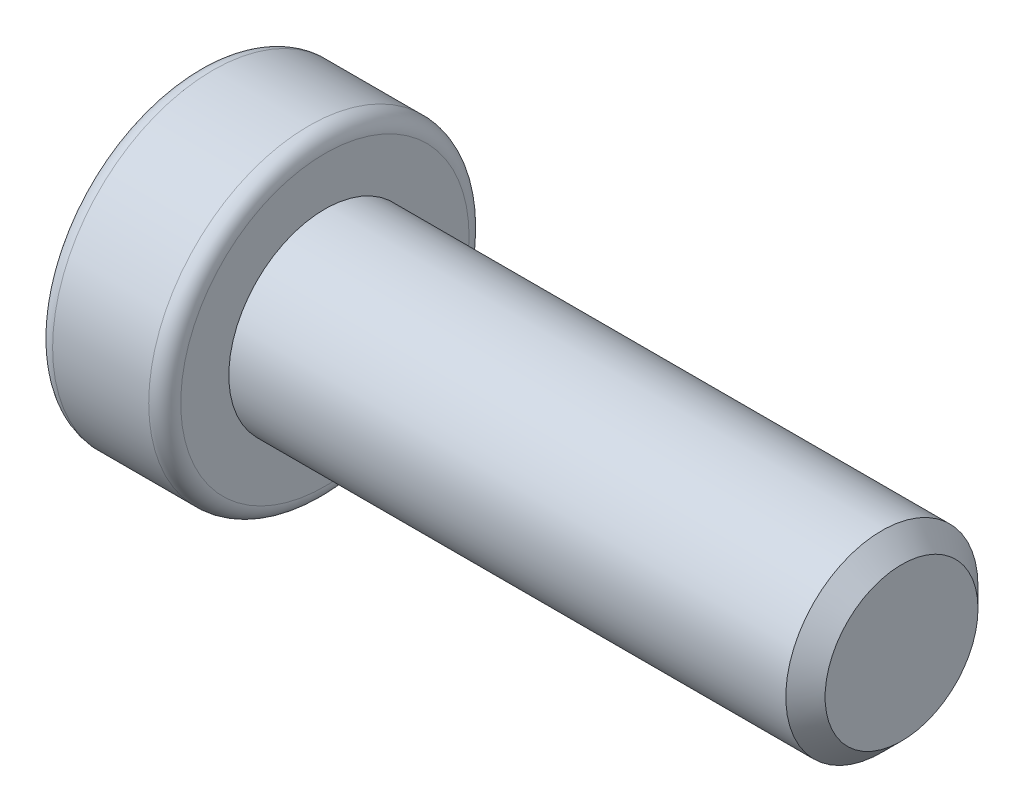
ISO-10303-21;
HEADER;
FILE_DESCRIPTION(('STEP AP214'),'2;1');
FILE_NAME('part.step','',(''),(''),'','','');
FILE_SCHEMA(('AUTOMOTIVE_DESIGN { 1 0 10303 214 1 1 1 1 }'));
ENDSEC;
DATA;
#1=APPLICATION_CONTEXT('core data for automotive mechanical design processes');
#2=APPLICATION_PROTOCOL_DEFINITION('international standard','automotive_design',2000,#1);
#3=PRODUCT_CONTEXT('',#1,'mechanical');
#4=PRODUCT('Part','Part','',(#3));
#5=PRODUCT_RELATED_PRODUCT_CATEGORY('part','',(#4));
#6=PRODUCT_DEFINITION_FORMATION('','',#4);
#7=PRODUCT_DEFINITION_CONTEXT('part definition',#1,'design');
#8=PRODUCT_DEFINITION('design','',#6,#7);
#9=PRODUCT_DEFINITION_SHAPE('','',#8);
#10=(LENGTH_UNIT() NAMED_UNIT(*) SI_UNIT(.MILLI.,.METRE.));
#11=(NAMED_UNIT(*) PLANE_ANGLE_UNIT() SI_UNIT($,.RADIAN.));
#12=(NAMED_UNIT(*) SI_UNIT($,.STERADIAN.) SOLID_ANGLE_UNIT());
#13=UNCERTAINTY_MEASURE_WITH_UNIT(LENGTH_MEASURE(1.E-05),#10,'distance_accuracy_value','');
#14=(GEOMETRIC_REPRESENTATION_CONTEXT(3) GLOBAL_UNCERTAINTY_ASSIGNED_CONTEXT((#13)) GLOBAL_UNIT_ASSIGNED_CONTEXT((#10,
#11,#12)) REPRESENTATION_CONTEXT('',''));
#15=CARTESIAN_POINT('',(0.,0.,0.));
#16=DIRECTION('',(0.,0.,1.));
#17=DIRECTION('',(1.,0.,0.));
#18=AXIS2_PLACEMENT_3D('',#15,#16,#17);
#19=CARTESIAN_POINT('',(-4.,0.,0.));
#20=DIRECTION('',(-1.,0.,0.));
#21=DIRECTION('',(0.,0.,1.));
#22=AXIS2_PLACEMENT_3D('',#19,#20,#21);
#23=CONICAL_SURFACE('',#22,2.8867513459481,0.785398163397447);
#24=CARTESIAN_POINT('',(-4.,0.,0.));
#25=DIRECTION('',(1.,0.,0.));
#26=DIRECTION('',(0.,0.,-1.));
#27=AXIS2_PLACEMENT_3D('',#24,#25,#26);
#28=CIRCLE('',#27,2.8867513459481);
#29=CARTESIAN_POINT('',(-4.,1.44337567297415,2.49999999999992));
#30=VERTEX_POINT('',#29);
#31=CARTESIAN_POINT('',(-4.,-1.4433756729741,2.5));
#32=VERTEX_POINT('',#31);
#33=EDGE_CURVE('E266',#30,#32,#28,.T.);
#34=ORIENTED_EDGE('',*,*,#33,.F.);
#35=CARTESIAN_POINT('',(-6.13577537813779,4.35611922405216,2.5));
#36=CARTESIAN_POINT('',(-6.02405641725019,4.22725866001411,2.5));
#37=CARTESIAN_POINT('',(-5.91298496215349,4.09782489086442,2.5));
#38=CARTESIAN_POINT('',(-5.69259879452268,3.83736651955329,2.5));
#39=CARTESIAN_POINT('',(-5.58328494304012,3.70634118973727,2.5));
#40=CARTESIAN_POINT('',(-5.3644942872461,3.43934006325918,2.5));
#41=CARTESIAN_POINT('',(-5.25507161834459,3.30331973073166,2.5));
#42=CARTESIAN_POINT('',(-5.03955046037824,3.02871290645588,2.5));
#43=CARTESIAN_POINT('',(-4.93345114490514,2.89012706652309,2.5));
#44=CARTESIAN_POINT('',(-4.72569625037672,2.60935358025566,2.5));
#45=CARTESIAN_POINT('',(-4.6240468245615,2.46716135079699,2.5));
#46=CARTESIAN_POINT('',(-4.42728703234703,2.17809364419259,2.5));
#47=CARTESIAN_POINT('',(-4.33218202887994,2.03121446717303,2.5));
#48=CARTESIAN_POINT('',(-4.15259291190784,1.73256542621068,2.5));
#49=CARTESIAN_POINT('',(-4.06803248336328,1.58084206421608,2.5));
#50=CARTESIAN_POINT('',(-3.91405163519297,1.26990866786595,2.5));
#51=CARTESIAN_POINT('',(-3.84460335921078,1.11071307737001,2.5));
#52=CARTESIAN_POINT('',(-3.75713367176379,0.863830735911973,2.5));
#53=CARTESIAN_POINT('',(-3.73056031651567,0.779188227940791,2.5));
#54=CARTESIAN_POINT('',(-3.68477521230842,0.607910212253461,2.5));
#55=CARTESIAN_POINT('',(-3.66556228833099,0.521275024991157,2.5));
#56=CARTESIAN_POINT('',(-3.63577461402971,0.347055167302584,2.5));
#57=CARTESIAN_POINT('',(-3.62514725633831,0.259479663207454,2.5));
#58=CARTESIAN_POINT('',(-3.61311288672129,0.0836918904943621,2.5));
#59=CARTESIAN_POINT('',(-3.61170490624327,-0.00452031025990465,2.5));
#60=CARTESIAN_POINT('',(-3.61822212538,-0.180706628736092,2.5));
#61=CARTESIAN_POINT('',(-3.62615950537357,-0.268680285623307,2.5));
#62=CARTESIAN_POINT('',(-3.65078694752075,-0.443384717226186,2.5));
#63=CARTESIAN_POINT('',(-3.66747873326785,-0.530115243734916,2.5));
#64=CARTESIAN_POINT('',(-3.70866876791723,-0.70232039045899,2.5));
#65=CARTESIAN_POINT('',(-3.73322158395549,-0.787781727344889,2.5));
#66=CARTESIAN_POINT('',(-3.78880674634175,-0.956537282986453,2.5));
#67=CARTESIAN_POINT('',(-3.81983916442736,-1.03983147773756,2.5));
#68=CARTESIAN_POINT('',(-3.89474881513276,-1.22278399037511,2.5));
#69=CARTESIAN_POINT('',(-3.93994460001272,-1.3218978611876,2.5));
#70=CARTESIAN_POINT('',(-4.03636406758988,-1.51717428919824,2.5));
#71=CARTESIAN_POINT('',(-4.08759123298222,-1.61333510041084,2.5));
#72=CARTESIAN_POINT('',(-4.19473393742912,-1.80324961470379,2.5));
#73=CARTESIAN_POINT('',(-4.25065896885275,-1.89699791868205,2.5));
#74=CARTESIAN_POINT('',(-4.3660273877593,-2.08226282648687,2.5));
#75=CARTESIAN_POINT('',(-4.4254700757917,-2.17377986890124,2.5));
#76=CARTESIAN_POINT('',(-4.54742331755096,-2.35544305197518,2.5));
#77=CARTESIAN_POINT('',(-4.60994847288594,-2.44557934493643,2.5));
#78=CARTESIAN_POINT('',(-4.73719466368033,-2.62429215374477,2.5));
#79=CARTESIAN_POINT('',(-4.80191586463725,-2.71286855126813,2.5));
#80=CARTESIAN_POINT('',(-4.99853021283134,-2.97643633428364,2.5));
#81=CARTESIAN_POINT('',(-5.13302426311325,-3.14948514704147,2.5));
#82=CARTESIAN_POINT('',(-5.41100964091669,-3.49742558299298,2.5));
#83=CARTESIAN_POINT('',(-5.55465127250697,-3.6721959345677,2.5));
#84=CARTESIAN_POINT('',(-5.77187642571591,-3.93128178305334,2.5));
#85=CARTESIAN_POINT('',(-5.84418027248006,-4.01667541105764,2.5));
#86=CARTESIAN_POINT('',(-5.98948272073259,-4.18683801333488,2.5));
#87=CARTESIAN_POINT('',(-6.06248116930567,-4.27160711812367,2.5));
#88=CARTESIAN_POINT('',(-6.13577537813778,-4.35611922405216,2.5));
#89=B_SPLINE_CURVE_WITH_KNOTS('',3,(#35,#36,#37,#38,#39,#40,#41,#42,#43,#44,#45,#46,#47,#48,#49,
#50,#51,#52,#53,#54,#55,#56,#57,#58,#59,#60,#61,#62,#63,#64,#65,#66,#67,#68,#69,#70,#71,#72,#73,
#74,#75,#76,#77,#78,#79,#80,#81,#82,#83,#84,#85,#86,#87,#88),.UNSPECIFIED.,.F.,.F.,(4,2,2,2,2,2,
2,2,2,2,2,2,2,2,2,2,2,2,2,2,2,2,2,2,2,2,4),(0.,0.511651260827455,1.02354597863304,
1.54722019644247,2.07076314295684,2.59500853626768,3.11967853721106,3.64029866615623,
4.15995084602471,4.42583268235064,4.69167205562896,4.95586989463534,5.22003997758481,
5.48455475102642,5.7491216224855,6.01556631338379,6.28201395432688,6.60853329817755,
6.93524211714075,7.26262772981255,7.58994846247599,7.91900556147604,8.24808751406481,
8.90545587878353,9.58407513821351,9.91974928830329,10.2553511756034),.UNSPECIFIED.);
#90=EDGE_CURVE('E65',#30,#32,#89,.T.);
#91=ORIENTED_EDGE('',*,*,#90,.T.);
#92=EDGE_LOOP('',(#34,#91));
#93=FACE_BOUND('',#92,.T.);
#94=ADVANCED_FACE('F42',(#93),#23,.F.);
#95=CARTESIAN_POINT('',(-4.,-2.8867513459481,0.));
#96=VERTEX_POINT('',#95);
#97=EDGE_CURVE('E271',#32,#96,#28,.T.);
#98=ORIENTED_EDGE('',*,*,#97,.F.);
#99=CARTESIAN_POINT('',(-4.00011547698181,-1.44326020292026,2.5002));
#100=CARTESIAN_POINT('',(-3.95054070535477,-1.49287669073472,2.41426172221223));
#101=CARTESIAN_POINT('',(-3.90387748136255,-1.54332283764113,2.32688643272424));
#102=CARTESIAN_POINT('',(-3.81843814003834,-1.64618811625262,2.1487185438344));
#103=CARTESIAN_POINT('',(-3.77970956240604,-1.69861703122362,2.05790899931892));
#104=CARTESIAN_POINT('',(-3.71336670389777,-1.80433744175988,1.87479587687306));
#105=CARTESIAN_POINT('',(-3.68558566853089,-1.85760201171318,1.78253893547064));
#106=CARTESIAN_POINT('',(-3.6427831759107,-1.96530378549012,1.59599399122369));
#107=CARTESIAN_POINT('',(-3.62772976667138,-2.01973769896309,1.50171168743369));
#108=CARTESIAN_POINT('',(-3.61414772220951,-2.11355131286835,1.33922174170813));
#109=CARTESIAN_POINT('',(-3.61213709924083,-2.15280980880343,1.27122403211982));
#110=CARTESIAN_POINT('',(-3.61552411718752,-2.23126263056551,1.13533975883075));
#111=CARTESIAN_POINT('',(-3.62092435529985,-2.27045692907359,1.06745324244773));
#112=CARTESIAN_POINT('',(-3.6388257884025,-2.34847544336506,0.932321211763864));
#113=CARTESIAN_POINT('',(-3.65133492704651,-2.38729919566124,0.865076500246409));
#114=CARTESIAN_POINT('',(-3.68276750195573,-2.46427534467604,0.73174989918177));
#115=CARTESIAN_POINT('',(-3.70169044649684,-2.50242779262542,0.665667920900312));
#116=CARTESIAN_POINT('',(-3.75786736140827,-2.60015256308362,0.496403653308709));
#117=CARTESIAN_POINT('',(-3.79935583159621,-2.65911894852988,0.394270877777087));
#118=CARTESIAN_POINT('',(-3.8693940467231,-2.74582384890656,0.244093585059479));
#119=CARTESIAN_POINT('',(-3.89400225211608,-2.7743969858641,0.194603460117381));
#120=CARTESIAN_POINT('',(-3.94546188671524,-2.83101398781791,0.0965399361611489));
#121=CARTESIAN_POINT('',(-3.97231193877936,-2.8590581649551,0.0479659965030702));
#122=CARTESIAN_POINT('',(-4.00011547698176,-2.88686681600194,-0.000199999999999587));
#123=B_SPLINE_CURVE_WITH_KNOTS('',3,(#99,#100,#101,#102,#103,#104,#105,#106,#107,#108,#109,#110,
#111,#112,#113,#114,#115,#116,#117,#118,#119,#120,#121,#122),.UNSPECIFIED.,.F.,.F.,(4,2,2,2,2,2,
2,2,2,2,2,4),(0.,0.33301208513393,0.667964518301408,0.997597032043316,1.32639954393847,
1.56169424147171,1.79707142102085,2.03271213522172,2.26833478775652,2.64260240809532,
2.82922877818861,3.01574133749021),.UNSPECIFIED.);
#124=EDGE_CURVE('E141',#32,#96,#123,.T.);
#125=ORIENTED_EDGE('',*,*,#124,.T.);
#126=EDGE_LOOP('',(#98,#125));
#127=FACE_BOUND('',#126,.T.);
#128=ADVANCED_FACE('F257',(#127),#23,.F.);
#129=CARTESIAN_POINT('',(-4.,-1.4433756729741,-2.5));
#130=VERTEX_POINT('',#129);
#131=EDGE_CURVE('E353',#96,#130,#28,.T.);
#132=ORIENTED_EDGE('',*,*,#131,.F.);
#133=CARTESIAN_POINT('',(-4.00011547698176,-2.88686681600194,0.000200000000000091));
#134=CARTESIAN_POINT('',(-3.95054070535473,-2.83725032818748,-0.0857382777877618));
#135=CARTESIAN_POINT('',(-3.90387748136251,-2.78680418128108,-0.173113567275748));
#136=CARTESIAN_POINT('',(-3.81843814003831,-2.68393890266959,-0.351281456165577));
#137=CARTESIAN_POINT('',(-3.77970956240602,-2.63150998769859,-0.44209100068106));
#138=CARTESIAN_POINT('',(-3.71336670389776,-2.52578957716234,-0.6252041231269));
#139=CARTESIAN_POINT('',(-3.68558566853088,-2.47252500720904,-0.717461064529317));
#140=CARTESIAN_POINT('',(-3.64278317591069,-2.36482323343211,-0.904006008776255));
#141=CARTESIAN_POINT('',(-3.62772976667137,-2.31038931995914,-0.998288312566249));
#142=CARTESIAN_POINT('',(-3.61414772220951,-2.21657570605389,-1.16077825829181));
#143=CARTESIAN_POINT('',(-3.61213709924083,-2.1773172101188,-1.22877596788011));
#144=CARTESIAN_POINT('',(-3.61552411718752,-2.09886438835673,-1.36466024116918));
#145=CARTESIAN_POINT('',(-3.62092435529985,-2.05967008984865,-1.4325467575522));
#146=CARTESIAN_POINT('',(-3.6388257884025,-1.98165157555718,-1.56767878823607));
#147=CARTESIAN_POINT('',(-3.65133492704651,-1.942827823261,-1.63492349975352));
#148=CARTESIAN_POINT('',(-3.68276750195574,-1.8658516742462,-1.76825010081816));
#149=CARTESIAN_POINT('',(-3.70169044649685,-1.82769922629682,-1.83433207909962));
#150=CARTESIAN_POINT('',(-3.75786736140828,-1.72997445583862,-2.00359634669123));
#151=CARTESIAN_POINT('',(-3.79935583159622,-1.67100807039235,-2.10572912222287));
#152=CARTESIAN_POINT('',(-3.86939404672313,-1.58430317001566,-2.25590641494049));
#153=CARTESIAN_POINT('',(-3.89400225211611,-1.55573003305811,-2.3053965398826));
#154=CARTESIAN_POINT('',(-3.94546188671528,-1.49911303110429,-2.40346006383884));
#155=CARTESIAN_POINT('',(-3.9723119387794,-1.4710688539671,-2.45203400349693));
#156=CARTESIAN_POINT('',(-4.00011547698181,-1.44326020292026,-2.5002));
#157=B_SPLINE_CURVE_WITH_KNOTS('',3,(#133,#134,#135,#136,#137,#138,#139,#140,#141,#142,#143,
#144,#145,#146,#147,#148,#149,#150,#151,#152,#153,#154,#155,#156),.UNSPECIFIED.,.F.,.F.,(4,2,2,
2,2,2,2,2,2,2,2,4),(0.,0.333012085133908,0.667964518301365,0.997597032043251,1.32639954393838,
1.56169424147162,1.79707142102076,2.03271213522164,2.26833478775643,2.64260240809528,
2.82922877818859,3.01574133749021),.UNSPECIFIED.);
#158=EDGE_CURVE('E193',#96,#130,#157,.T.);
#159=ORIENTED_EDGE('',*,*,#158,.T.);
#160=EDGE_LOOP('',(#132,#159));
#161=FACE_BOUND('',#160,.T.);
#162=ADVANCED_FACE('F262',(#161),#23,.F.);
#163=CARTESIAN_POINT('',(-4.,1.4433756729741,-2.5));
#164=VERTEX_POINT('',#163);
#165=EDGE_CURVE('E278',#130,#164,#28,.T.);
#166=ORIENTED_EDGE('',*,*,#165,.F.);
#167=CARTESIAN_POINT('',(-6.13577537813779,-4.35611922405216,-2.5));
#168=CARTESIAN_POINT('',(-6.02405641725019,-4.22725866001411,-2.5));
#169=CARTESIAN_POINT('',(-5.91298496215349,-4.09782489086442,-2.5));
#170=CARTESIAN_POINT('',(-5.69259879452268,-3.83736651955329,-2.5));
#171=CARTESIAN_POINT('',(-5.58328494304012,-3.70634118973727,-2.5));
#172=CARTESIAN_POINT('',(-5.3644942872461,-3.43934006325918,-2.5));
#173=CARTESIAN_POINT('',(-5.25507161834459,-3.30331973073166,-2.5));
#174=CARTESIAN_POINT('',(-5.03955046037824,-3.02871290645588,-2.5));
#175=CARTESIAN_POINT('',(-4.93345114490514,-2.89012706652309,-2.5));
#176=CARTESIAN_POINT('',(-4.72569625037672,-2.60935358025566,-2.5));
#177=CARTESIAN_POINT('',(-4.6240468245615,-2.46716135079699,-2.5));
#178=CARTESIAN_POINT('',(-4.42728703234703,-2.17809364419259,-2.5));
#179=CARTESIAN_POINT('',(-4.33218202887994,-2.03121446717303,-2.5));
#180=CARTESIAN_POINT('',(-4.15259291190784,-1.73256542621068,-2.5));
#181=CARTESIAN_POINT('',(-4.06803248336328,-1.58084206421608,-2.5));
#182=CARTESIAN_POINT('',(-3.91405163519297,-1.26990866786595,-2.5));
#183=CARTESIAN_POINT('',(-3.84460335921078,-1.11071307737001,-2.5));
#184=CARTESIAN_POINT('',(-3.75713367176379,-0.863830735911973,-2.5));
#185=CARTESIAN_POINT('',(-3.73056031651567,-0.779188227940791,-2.5));
#186=CARTESIAN_POINT('',(-3.68477521230842,-0.607910212253461,-2.5));
#187=CARTESIAN_POINT('',(-3.66556228833099,-0.521275024991157,-2.5));
#188=CARTESIAN_POINT('',(-3.63577461402971,-0.347055167302584,-2.5));
#189=CARTESIAN_POINT('',(-3.62514725633831,-0.259479663207454,-2.5));
#190=CARTESIAN_POINT('',(-3.61311288672129,-0.0836918904943621,-2.5));
#191=CARTESIAN_POINT('',(-3.61170490624327,0.00452031025990465,-2.5));
#192=CARTESIAN_POINT('',(-3.61822212538,0.180706628736092,-2.5));
#193=CARTESIAN_POINT('',(-3.62615950537357,0.268680285623307,-2.5));
#194=CARTESIAN_POINT('',(-3.65078694752075,0.443384717226186,-2.5));
#195=CARTESIAN_POINT('',(-3.66747873326785,0.530115243734916,-2.5));
#196=CARTESIAN_POINT('',(-3.70866876791723,0.70232039045899,-2.5));
#197=CARTESIAN_POINT('',(-3.73322158395549,0.787781727344889,-2.5));
#198=CARTESIAN_POINT('',(-3.78880674634175,0.956537282986453,-2.5));
#199=CARTESIAN_POINT('',(-3.81983916442736,1.03983147773756,-2.5));
#200=CARTESIAN_POINT('',(-3.89474881513276,1.22278399037511,-2.5));
#201=CARTESIAN_POINT('',(-3.93994460001272,1.3218978611876,-2.5));
#202=CARTESIAN_POINT('',(-4.03636406758988,1.51717428919824,-2.5));
#203=CARTESIAN_POINT('',(-4.08759123298222,1.61333510041084,-2.5));
#204=CARTESIAN_POINT('',(-4.19473393742912,1.80324961470379,-2.5));
#205=CARTESIAN_POINT('',(-4.25065896885275,1.89699791868205,-2.5));
#206=CARTESIAN_POINT('',(-4.3660273877593,2.08226282648687,-2.5));
#207=CARTESIAN_POINT('',(-4.4254700757917,2.17377986890124,-2.5));
#208=CARTESIAN_POINT('',(-4.54742331755096,2.35544305197518,-2.5));
#209=CARTESIAN_POINT('',(-4.60994847288594,2.44557934493643,-2.5));
#210=CARTESIAN_POINT('',(-4.73719466368033,2.62429215374477,-2.5));
#211=CARTESIAN_POINT('',(-4.80191586463725,2.71286855126813,-2.5));
#212=CARTESIAN_POINT('',(-4.99853021283134,2.97643633428364,-2.5));
#213=CARTESIAN_POINT('',(-5.13302426311325,3.14948514704147,-2.5));
#214=CARTESIAN_POINT('',(-5.41100964091669,3.49742558299298,-2.5));
#215=CARTESIAN_POINT('',(-5.55465127250697,3.6721959345677,-2.5));
#216=CARTESIAN_POINT('',(-5.77187642571591,3.93128178305334,-2.5));
#217=CARTESIAN_POINT('',(-5.84418027248006,4.01667541105764,-2.5));
#218=CARTESIAN_POINT('',(-5.98948272073259,4.18683801333488,-2.5));
#219=CARTESIAN_POINT('',(-6.06248116930567,4.27160711812367,-2.5));
#220=CARTESIAN_POINT('',(-6.13577537813778,4.35611922405216,-2.5));
#221=B_SPLINE_CURVE_WITH_KNOTS('',3,(#167,#168,#169,#170,#171,#172,#173,#174,#175,#176,#177,
#178,#179,#180,#181,#182,#183,#184,#185,#186,#187,#188,#189,#190,#191,#192,#193,#194,#195,#196,
#197,#198,#199,#200,#201,#202,#203,#204,#205,#206,#207,#208,#209,#210,#211,#212,#213,#214,#215,
#216,#217,#218,#219,#220),.UNSPECIFIED.,.F.,.F.,(4,2,2,2,2,2,2,2,2,2,2,2,2,2,2,2,2,2,2,2,2,2,2,
2,2,2,4),(0.,0.511651260827455,1.02354597863304,1.54722019644247,2.07076314295684,
2.59500853626768,3.11967853721106,3.64029866615623,4.15995084602471,4.42583268235064,
4.69167205562896,4.95586989463534,5.22003997758481,5.48455475102642,5.7491216224855,
6.01556631338379,6.28201395432688,6.60853329817755,6.93524211714075,7.26262772981255,
7.58994846247599,7.91900556147604,8.24808751406481,8.90545587878353,9.58407513821351,
9.91974928830329,10.2553511756034),.UNSPECIFIED.);
#222=EDGE_CURVE('E186',#130,#164,#221,.T.);
#223=ORIENTED_EDGE('',*,*,#222,.T.);
#224=EDGE_LOOP('',(#166,#223));
#225=FACE_BOUND('',#224,.T.);
#226=ADVANCED_FACE('F355',(#225),#23,.F.);
#227=CARTESIAN_POINT('',(-4.,2.8867513459481,0.));
#228=VERTEX_POINT('',#227);
#229=EDGE_CURVE('E276',#164,#228,#28,.T.);
#230=ORIENTED_EDGE('',*,*,#229,.F.);
#231=CARTESIAN_POINT('',(-4.00011547698181,1.44326020292026,-2.5002));
#232=CARTESIAN_POINT('',(-3.95054070535477,1.49287669073472,-2.41426172221223));
#233=CARTESIAN_POINT('',(-3.90387748136255,1.54332283764113,-2.32688643272424));
#234=CARTESIAN_POINT('',(-3.81843814003834,1.64618811625262,-2.1487185438344));
#235=CARTESIAN_POINT('',(-3.77970956240604,1.69861703122362,-2.05790899931892));
#236=CARTESIAN_POINT('',(-3.71336670389777,1.80433744175988,-1.87479587687306));
#237=CARTESIAN_POINT('',(-3.68558566853089,1.85760201171318,-1.78253893547064));
#238=CARTESIAN_POINT('',(-3.6427831759107,1.96530378549012,-1.59599399122369));
#239=CARTESIAN_POINT('',(-3.62772976667138,2.01973769896309,-1.50171168743369));
#240=CARTESIAN_POINT('',(-3.61414772220951,2.11355131286835,-1.33922174170813));
#241=CARTESIAN_POINT('',(-3.61213709924083,2.15280980880343,-1.27122403211982));
#242=CARTESIAN_POINT('',(-3.61552411718752,2.23126263056551,-1.13533975883075));
#243=CARTESIAN_POINT('',(-3.62092435529985,2.27045692907359,-1.06745324244773));
#244=CARTESIAN_POINT('',(-3.6388257884025,2.34847544336506,-0.932321211763864));
#245=CARTESIAN_POINT('',(-3.65133492704651,2.38729919566124,-0.865076500246409));
#246=CARTESIAN_POINT('',(-3.68276750195573,2.46427534467604,-0.73174989918177));
#247=CARTESIAN_POINT('',(-3.70169044649684,2.50242779262542,-0.665667920900312));
#248=CARTESIAN_POINT('',(-3.75786736140827,2.60015256308362,-0.496403653308709));
#249=CARTESIAN_POINT('',(-3.79935583159621,2.65911894852988,-0.394270877777087));
#250=CARTESIAN_POINT('',(-3.8693940467231,2.74582384890656,-0.244093585059479));
#251=CARTESIAN_POINT('',(-3.89400225211608,2.7743969858641,-0.194603460117381));
#252=CARTESIAN_POINT('',(-3.94546188671524,2.83101398781791,-0.0965399361611489));
#253=CARTESIAN_POINT('',(-3.97231193877936,2.8590581649551,-0.0479659965030702));
#254=CARTESIAN_POINT('',(-4.00011547698176,2.88686681600194,0.000199999999999587));
#255=B_SPLINE_CURVE_WITH_KNOTS('',3,(#231,#232,#233,#234,#235,#236,#237,#238,#239,#240,#241,
#242,#243,#244,#245,#246,#247,#248,#249,#250,#251,#252,#253,#254),.UNSPECIFIED.,.F.,.F.,(4,2,2,
2,2,2,2,2,2,2,2,4),(0.,0.33301208513393,0.667964518301408,0.997597032043316,1.32639954393847,
1.56169424147171,1.79707142102085,2.03271213522172,2.26833478775652,2.64260240809532,
2.82922877818861,3.01574133749021),.UNSPECIFIED.);
#256=EDGE_CURVE('E146',#164,#228,#255,.T.);
#257=ORIENTED_EDGE('',*,*,#256,.T.);
#258=EDGE_LOOP('',(#230,#257));
#259=FACE_BOUND('',#258,.T.);
#260=ADVANCED_FACE('F252',(#259),#23,.F.);
#261=EDGE_CURVE('E270',#228,#30,#28,.T.);
#262=ORIENTED_EDGE('',*,*,#261,.F.);
#263=CARTESIAN_POINT('',(-4.00011547698176,2.88686681600194,-0.000200000000000091));
#264=CARTESIAN_POINT('',(-3.95054070535473,2.83725032818748,0.0857382777877618));
#265=CARTESIAN_POINT('',(-3.90387748136251,2.78680418128108,0.173113567275748));
#266=CARTESIAN_POINT('',(-3.81843814003831,2.68393890266959,0.351281456165577));
#267=CARTESIAN_POINT('',(-3.77970956240602,2.63150998769859,0.44209100068106));
#268=CARTESIAN_POINT('',(-3.71336670389776,2.52578957716234,0.6252041231269));
#269=CARTESIAN_POINT('',(-3.68558566853088,2.47252500720904,0.717461064529317));
#270=CARTESIAN_POINT('',(-3.64278317591069,2.36482323343211,0.904006008776255));
#271=CARTESIAN_POINT('',(-3.62772976667137,2.31038931995914,0.998288312566249));
#272=CARTESIAN_POINT('',(-3.61414772220951,2.21657570605389,1.16077825829181));
#273=CARTESIAN_POINT('',(-3.61213709924083,2.1773172101188,1.22877596788011));
#274=CARTESIAN_POINT('',(-3.61552411718752,2.09886438835673,1.36466024116918));
#275=CARTESIAN_POINT('',(-3.62092435529985,2.05967008984865,1.4325467575522));
#276=CARTESIAN_POINT('',(-3.6388257884025,1.98165157555718,1.56767878823607));
#277=CARTESIAN_POINT('',(-3.65133492704651,1.942827823261,1.63492349975352));
#278=CARTESIAN_POINT('',(-3.68276750195574,1.8658516742462,1.76825010081816));
#279=CARTESIAN_POINT('',(-3.70169044649685,1.82769922629682,1.83433207909962));
#280=CARTESIAN_POINT('',(-3.75786736140828,1.72997445583862,2.00359634669123));
#281=CARTESIAN_POINT('',(-3.79935583159622,1.67100807039235,2.10572912222287));
#282=CARTESIAN_POINT('',(-3.86939404672313,1.58430317001566,2.25590641494049));
#283=CARTESIAN_POINT('',(-3.89400225211611,1.55573003305811,2.3053965398826));
#284=CARTESIAN_POINT('',(-3.94546188671528,1.49911303110429,2.40346006383884));
#285=CARTESIAN_POINT('',(-3.9723119387794,1.4710688539671,2.45203400349693));
#286=CARTESIAN_POINT('',(-4.00011547698181,1.44326020292026,2.5002));
#287=B_SPLINE_CURVE_WITH_KNOTS('',3,(#263,#264,#265,#266,#267,#268,#269,#270,#271,#272,#273,
#274,#275,#276,#277,#278,#279,#280,#281,#282,#283,#284,#285,#286),.UNSPECIFIED.,.F.,.F.,(4,2,2,
2,2,2,2,2,2,2,2,4),(0.,0.333012085133908,0.667964518301365,0.997597032043251,1.32639954393838,
1.56169424147162,1.79707142102076,2.03271213522164,2.26833478775643,2.64260240809528,
2.82922877818859,3.01574133749021),.UNSPECIFIED.);
#288=EDGE_CURVE('E142',#228,#30,#287,.T.);
#289=ORIENTED_EDGE('',*,*,#288,.T.);
#290=EDGE_LOOP('',(#262,#289));
#291=FACE_BOUND('',#290,.T.);
#292=ADVANCED_FACE('F247',(#291),#23,.F.);
#293=CARTESIAN_POINT('',(-4.,2.8867513459481,0.));
#294=DIRECTION('',(-1.,0.,0.));
#295=DIRECTION('',(0.,0.,1.));
#296=AXIS2_PLACEMENT_3D('',#293,#294,#295);
#297=PLANE('',#296);
#298=ORIENTED_EDGE('',*,*,#229,.T.);
#299=ORIENTED_EDGE('',*,*,#261,.T.);
#300=ORIENTED_EDGE('',*,*,#33,.T.);
#301=ORIENTED_EDGE('',*,*,#97,.T.);
#302=ORIENTED_EDGE('',*,*,#131,.T.);
#303=ORIENTED_EDGE('',*,*,#165,.T.);
#304=EDGE_LOOP('',(#298,#299,#300,#301,#302,#303));
#305=FACE_BOUND('',#304,.T.);
#306=CARTESIAN_POINT('',(-4.,0.,0.));
#307=DIRECTION('',(1.,0.,0.));
#308=DIRECTION('',(0.,0.,-1.));
#309=AXIS2_PLACEMENT_3D('',#306,#307,#308);
#310=CIRCLE('',#309,4.5);
#311=CARTESIAN_POINT('',(-4.,0.,-4.5));
#312=VERTEX_POINT('',#311);
#313=EDGE_CURVE('E281',#312,#312,#310,.T.);
#314=ORIENTED_EDGE('',*,*,#313,.F.);
#315=EDGE_LOOP('',(#314));
#316=FACE_BOUND('',#315,.T.);
#317=ADVANCED_FACE('F244',(#305,#316),#297,.T.);
#318=CARTESIAN_POINT('',(-3.50000000000009,0.,0.));
#319=DIRECTION('',(1.,0.,0.));
#320=DIRECTION('',(0.,0.,-1.));
#321=AXIS2_PLACEMENT_3D('',#318,#319,#320);
#322=TOROIDAL_SURFACE('',#321,4.50000000000009,0.49999999999991);
#323=ORIENTED_EDGE('',*,*,#313,.T.);
#324=EDGE_LOOP('',(#323));
#325=FACE_BOUND('',#324,.T.);
#326=CARTESIAN_POINT('',(-3.5,0.,0.));
#327=DIRECTION('',(1.,0.,0.));
#328=DIRECTION('',(0.,0.,-1.));
#329=AXIS2_PLACEMENT_3D('',#326,#327,#328);
#330=CIRCLE('',#329,5.);
#331=CARTESIAN_POINT('',(-3.5,0.,-5.));
#332=VERTEX_POINT('',#331);
#333=EDGE_CURVE('E357',#332,#332,#330,.T.);
#334=ORIENTED_EDGE('',*,*,#333,.F.);
#335=EDGE_LOOP('',(#334));
#336=FACE_BOUND('',#335,.T.);
#337=ADVANCED_FACE('F241',(#325,#336),#322,.T.);
#338=CARTESIAN_POINT('',(18.,0.,0.));
#339=DIRECTION('',(1.,0.,0.));
#340=DIRECTION('',(0.,0.,-1.));
#341=AXIS2_PLACEMENT_3D('',#338,#339,#340);
#342=CYLINDRICAL_SURFACE('',#341,5.);
#343=ORIENTED_EDGE('',*,*,#333,.T.);
#344=EDGE_LOOP('',(#343));
#345=FACE_BOUND('',#344,.T.);
#346=CARTESIAN_POINT('',(-0.5,0.,0.));
#347=DIRECTION('',(1.,0.,0.));
#348=DIRECTION('',(0.,0.,-1.));
#349=AXIS2_PLACEMENT_3D('',#346,#347,#348);
#350=CIRCLE('',#349,5.);
#351=CARTESIAN_POINT('',(-0.5,0.,-5.));
#352=VERTEX_POINT('',#351);
#353=EDGE_CURVE('E360',#352,#352,#350,.T.);
#354=ORIENTED_EDGE('',*,*,#353,.F.);
#355=EDGE_LOOP('',(#354));
#356=FACE_BOUND('',#355,.T.);
#357=ADVANCED_FACE('F237',(#345,#356),#342,.T.);
#358=CARTESIAN_POINT('',(-0.499999999999962,0.,0.));
#359=DIRECTION('',(1.,0.,0.));
#360=DIRECTION('',(0.,0.,-1.));
#361=AXIS2_PLACEMENT_3D('',#358,#359,#360);
#362=TOROIDAL_SURFACE('',#361,4.50000000000004,0.499999999999962);
#363=ORIENTED_EDGE('',*,*,#353,.T.);
#364=EDGE_LOOP('',(#363));
#365=FACE_BOUND('',#364,.T.);
#366=CARTESIAN_POINT('',(0.,0.,0.));
#367=DIRECTION('',(1.,0.,0.));
#368=DIRECTION('',(0.,0.,-1.));
#369=AXIS2_PLACEMENT_3D('',#366,#367,#368);
#370=CIRCLE('',#369,4.5);
#371=CARTESIAN_POINT('',(0.,0.,-4.5));
#372=VERTEX_POINT('',#371);
#373=EDGE_CURVE('E363',#372,#372,#370,.T.);
#374=ORIENTED_EDGE('',*,*,#373,.F.);
#375=EDGE_LOOP('',(#374));
#376=FACE_BOUND('',#375,.T.);
#377=ADVANCED_FACE('F233',(#365,#376),#362,.T.);
#378=CARTESIAN_POINT('',(0.,4.5,0.));
#379=DIRECTION('',(1.,0.,0.));
#380=DIRECTION('',(0.,0.,-1.));
#381=AXIS2_PLACEMENT_3D('',#378,#379,#380);
#382=PLANE('',#381);
#383=ORIENTED_EDGE('',*,*,#373,.T.);
#384=EDGE_LOOP('',(#383));
#385=FACE_BOUND('',#384,.T.);
#386=CARTESIAN_POINT('',(0.,0.,0.));
#387=DIRECTION('',(1.,0.,0.));
#388=DIRECTION('',(0.,0.,-1.));
#389=AXIS2_PLACEMENT_3D('',#386,#387,#388);
#390=CIRCLE('',#389,3.);
#391=CARTESIAN_POINT('',(0.,0.,-3.));
#392=VERTEX_POINT('',#391);
#393=EDGE_CURVE('E368',#392,#392,#390,.T.);
#394=ORIENTED_EDGE('',*,*,#393,.F.);
#395=EDGE_LOOP('',(#394));
#396=FACE_BOUND('',#395,.T.);
#397=ADVANCED_FACE('F229',(#385,#396),#382,.T.);
#398=CARTESIAN_POINT('',(18.,0.,0.));
#399=DIRECTION('',(1.,0.,0.));
#400=DIRECTION('',(0.,0.,-1.));
#401=AXIS2_PLACEMENT_3D('',#398,#399,#400);
#402=CYLINDRICAL_SURFACE('',#401,3.);
#403=ORIENTED_EDGE('',*,*,#393,.T.);
#404=EDGE_LOOP('',(#403));
#405=FACE_BOUND('',#404,.T.);
#406=CARTESIAN_POINT('',(17.3865,0.,0.));
#407=DIRECTION('',(1.,0.,0.));
#408=DIRECTION('',(0.,0.,-1.));
#409=AXIS2_PLACEMENT_3D('',#406,#407,#408);
#410=CIRCLE('',#409,3.);
#411=CARTESIAN_POINT('',(17.3865,0.,-3.));
#412=VERTEX_POINT('',#411);
#413=EDGE_CURVE('E371',#412,#412,#410,.T.);
#414=ORIENTED_EDGE('',*,*,#413,.F.);
#415=EDGE_LOOP('',(#414));
#416=FACE_BOUND('',#415,.T.);
#417=ADVANCED_FACE('F225',(#405,#416),#402,.T.);
#418=CARTESIAN_POINT('',(18.,0.,0.));
#419=DIRECTION('',(-1.,0.,0.));
#420=DIRECTION('',(0.,0.,1.));
#421=AXIS2_PLACEMENT_3D('',#418,#419,#420);
#422=CONICAL_SURFACE('',#421,2.3865,0.785398163397449);
#423=ORIENTED_EDGE('',*,*,#413,.T.);
#424=EDGE_LOOP('',(#423));
#425=FACE_BOUND('',#424,.T.);
#426=CARTESIAN_POINT('',(18.,0.,0.));
#427=DIRECTION('',(1.,0.,0.));
#428=DIRECTION('',(0.,0.,-1.));
#429=AXIS2_PLACEMENT_3D('',#426,#427,#428);
#430=CIRCLE('',#429,2.3865);
#431=CARTESIAN_POINT('',(18.,0.,-2.3865));
#432=VERTEX_POINT('',#431);
#433=EDGE_CURVE('E373',#432,#432,#430,.T.);
#434=ORIENTED_EDGE('',*,*,#433,.F.);
#435=EDGE_LOOP('',(#434));
#436=FACE_BOUND('',#435,.T.);
#437=ADVANCED_FACE('F221',(#425,#436),#422,.T.);
#438=CARTESIAN_POINT('',(18.,2.3865,0.));
#439=DIRECTION('',(1.,0.,0.));
#440=DIRECTION('',(0.,0.,-1.));
#441=AXIS2_PLACEMENT_3D('',#438,#439,#440);
#442=PLANE('',#441);
#443=ORIENTED_EDGE('',*,*,#433,.T.);
#444=EDGE_LOOP('',(#443));
#445=FACE_BOUND('',#444,.T.);
#446=ADVANCED_FACE('F217',(#445),#442,.T.);
#447=CARTESIAN_POINT('',(-1.5,0.,0.));
#448=DIRECTION('',(1.,0.,0.));
#449=DIRECTION('',(0.,0.,-1.));
#450=AXIS2_PLACEMENT_3D('',#447,#448,#449);
#451=PLANE('',#450);
#452=CARTESIAN_POINT('',(-1.5,0.,0.));
#453=DIRECTION('',(1.,0.,0.));
#454=DIRECTION('',(0.,0.,-1.));
#455=AXIS2_PLACEMENT_3D('',#452,#453,#454);
#456=CIRCLE('',#455,2.5);
#457=CARTESIAN_POINT('',(-1.5,0.,-2.5));
#458=VERTEX_POINT('',#457);
#459=CARTESIAN_POINT('',(-1.5,2.16506350946112,-1.24999999999996));
#460=VERTEX_POINT('',#459);
#461=EDGE_CURVE('E283',#458,#460,#456,.T.);
#462=ORIENTED_EDGE('',*,*,#461,.T.);
#463=DIRECTION('',(0.,0.499999999999983,0.866025403784448));
#464=VECTOR('',#463,1.);
#465=CARTESIAN_POINT('',(-1.5,1.4433756729741,-2.5));
#466=LINE('',#465,#464);
#467=CARTESIAN_POINT('',(-1.5,1.4433756729741,-2.5));
#468=VERTEX_POINT('',#467);
#469=EDGE_CURVE('E329',#468,#460,#466,.T.);
#470=ORIENTED_EDGE('',*,*,#469,.F.);
#471=DIRECTION('',(0.,1.,0.));
#472=VECTOR('',#471,1.);
#473=CARTESIAN_POINT('',(-1.5,-1.4433756729741,-2.5));
#474=LINE('',#473,#472);
#475=EDGE_CURVE('E326',#458,#468,#474,.T.);
#476=ORIENTED_EDGE('',*,*,#475,.F.);
#477=EDGE_LOOP('',(#462,#470,#476));
#478=FACE_BOUND('',#477,.T.);
#479=ADVANCED_FACE('F220',(#478),#451,.F.);
#480=CARTESIAN_POINT('',(-1.5,2.16506350946112,1.24999999999996));
#481=VERTEX_POINT('',#480);
#482=EDGE_CURVE('E284',#460,#481,#456,.T.);
#483=ORIENTED_EDGE('',*,*,#482,.T.);
#484=DIRECTION('',(0.,-0.499999999999983,0.866025403784448));
#485=VECTOR('',#484,1.);
#486=CARTESIAN_POINT('',(-1.5,2.8867513459481,0.));
#487=LINE('',#486,#485);
#488=CARTESIAN_POINT('',(-1.5,2.8867513459481,0.));
#489=VERTEX_POINT('',#488);
#490=EDGE_CURVE('E340',#489,#481,#487,.T.);
#491=ORIENTED_EDGE('',*,*,#490,.F.);
#492=EDGE_CURVE('E335',#460,#489,#466,.T.);
#493=ORIENTED_EDGE('',*,*,#492,.F.);
#494=EDGE_LOOP('',(#483,#491,#493));
#495=FACE_BOUND('',#494,.T.);
#496=ADVANCED_FACE('F308',(#495),#451,.F.);
#497=CARTESIAN_POINT('',(-1.5,0.,2.5));
#498=VERTEX_POINT('',#497);
#499=EDGE_CURVE('E393',#481,#498,#456,.T.);
#500=ORIENTED_EDGE('',*,*,#499,.T.);
#501=DIRECTION('',(0.,-1.,0.));
#502=VECTOR('',#501,1.);
#503=CARTESIAN_POINT('',(-1.5,1.4433756729741,2.5));
#504=LINE('',#503,#502);
#505=CARTESIAN_POINT('',(-1.5,1.4433756729741,2.5));
#506=VERTEX_POINT('',#505);
#507=EDGE_CURVE('E124',#506,#498,#504,.T.);
#508=ORIENTED_EDGE('',*,*,#507,.F.);
#509=EDGE_CURVE('E339',#481,#506,#487,.T.);
#510=ORIENTED_EDGE('',*,*,#509,.F.);
#511=EDGE_LOOP('',(#500,#508,#510));
#512=FACE_BOUND('',#511,.T.);
#513=ADVANCED_FACE('F315',(#512),#451,.F.);
#514=CARTESIAN_POINT('',(-1.5,-2.16506350946112,1.24999999999996));
#515=VERTEX_POINT('',#514);
#516=EDGE_CURVE('E131',#498,#515,#456,.T.);
#517=ORIENTED_EDGE('',*,*,#516,.T.);
#518=DIRECTION('',(0.,-0.499999999999983,-0.866025403784448));
#519=VECTOR('',#518,1.);
#520=CARTESIAN_POINT('',(-1.5,-1.4433756729741,2.5));
#521=LINE('',#520,#519);
#522=CARTESIAN_POINT('',(-1.5,-1.4433756729741,2.5));
#523=VERTEX_POINT('',#522);
#524=EDGE_CURVE('E129',#523,#515,#521,.T.);
#525=ORIENTED_EDGE('',*,*,#524,.F.);
#526=EDGE_CURVE('E118',#498,#523,#504,.T.);
#527=ORIENTED_EDGE('',*,*,#526,.F.);
#528=EDGE_LOOP('',(#517,#525,#527));
#529=FACE_BOUND('',#528,.T.);
#530=ADVANCED_FACE('F130',(#529),#451,.F.);
#531=CARTESIAN_POINT('',(-1.5,-2.16506350946112,-1.24999999999996));
#532=VERTEX_POINT('',#531);
#533=EDGE_CURVE('E317',#515,#532,#456,.T.);
#534=ORIENTED_EDGE('',*,*,#533,.T.);
#535=DIRECTION('',(0.,0.499999999999983,-0.866025403784448));
#536=VECTOR('',#535,1.);
#537=CARTESIAN_POINT('',(-1.5,-2.8867513459481,0.));
#538=LINE('',#537,#536);
#539=CARTESIAN_POINT('',(-1.5,-2.8867513459481,0.));
#540=VERTEX_POINT('',#539);
#541=EDGE_CURVE('E57',#540,#532,#538,.T.);
#542=ORIENTED_EDGE('',*,*,#541,.F.);
#543=EDGE_CURVE('E136',#515,#540,#521,.T.);
#544=ORIENTED_EDGE('',*,*,#543,.F.);
#545=EDGE_LOOP('',(#534,#542,#544));
#546=FACE_BOUND('',#545,.T.);
#547=ADVANCED_FACE('F216',(#546),#451,.F.);
#548=CARTESIAN_POINT('',(-1.5,1.4433756729741,2.5));
#549=DIRECTION('',(0.,0.,-1.));
#550=DIRECTION('',(-1.,0.,0.));
#551=AXIS2_PLACEMENT_3D('',#548,#549,#550);
#552=PLANE('',#551);
#553=ORIENTED_EDGE('',*,*,#90,.F.);
#554=DIRECTION('',(-1.,0.,0.));
#555=VECTOR('',#554,1.);
#556=CARTESIAN_POINT('',(-1.5,1.4433756729741,2.5));
#557=LINE('',#556,#555);
#558=EDGE_CURVE('E343',#506,#30,#557,.T.);
#559=ORIENTED_EDGE('',*,*,#558,.F.);
#560=ORIENTED_EDGE('',*,*,#507,.T.);
#561=ORIENTED_EDGE('',*,*,#526,.T.);
#562=DIRECTION('',(-1.,0.,0.));
#563=VECTOR('',#562,1.);
#564=CARTESIAN_POINT('',(-1.5,-1.4433756729741,2.5));
#565=LINE('',#564,#563);
#566=EDGE_CURVE('E122',#523,#32,#565,.T.);
#567=ORIENTED_EDGE('',*,*,#566,.T.);
#568=EDGE_LOOP('',(#553,#559,#560,#561,#567));
#569=FACE_BOUND('',#568,.T.);
#570=ADVANCED_FACE('F120',(#569),#552,.T.);
#571=CARTESIAN_POINT('',(-1.5,-1.4433756729741,2.5));
#572=DIRECTION('',(0.,0.866025403784448,-0.499999999999983));
#573=DIRECTION('',(0.,0.499999999999983,0.866025403784448));
#574=AXIS2_PLACEMENT_3D('',#571,#572,#573);
#575=PLANE('',#574);
#576=ORIENTED_EDGE('',*,*,#124,.F.);
#577=ORIENTED_EDGE('',*,*,#566,.F.);
#578=ORIENTED_EDGE('',*,*,#524,.T.);
#579=ORIENTED_EDGE('',*,*,#543,.T.);
#580=DIRECTION('',(-1.,0.,0.));
#581=VECTOR('',#580,1.);
#582=CARTESIAN_POINT('',(-1.5,-2.8867513459481,0.));
#583=LINE('',#582,#581);
#584=EDGE_CURVE('E143',#540,#96,#583,.T.);
#585=ORIENTED_EDGE('',*,*,#584,.T.);
#586=EDGE_LOOP('',(#576,#577,#578,#579,#585));
#587=FACE_BOUND('',#586,.T.);
#588=ADVANCED_FACE('F138',(#587),#575,.T.);
#589=CARTESIAN_POINT('',(-1.5,-2.8867513459481,0.));
#590=DIRECTION('',(0.,0.866025403784448,0.499999999999983));
#591=DIRECTION('',(0.,-0.499999999999983,0.866025403784448));
#592=AXIS2_PLACEMENT_3D('',#589,#590,#591);
#593=PLANE('',#592);
#594=ORIENTED_EDGE('',*,*,#158,.F.);
#595=ORIENTED_EDGE('',*,*,#584,.F.);
#596=ORIENTED_EDGE('',*,*,#541,.T.);
#597=CARTESIAN_POINT('',(-1.5,-1.4433756729741,-2.5));
#598=VERTEX_POINT('',#597);
#599=EDGE_CURVE('E135',#532,#598,#538,.T.);
#600=ORIENTED_EDGE('',*,*,#599,.T.);
#601=DIRECTION('',(-1.,0.,0.));
#602=VECTOR('',#601,1.);
#603=CARTESIAN_POINT('',(-1.5,-1.4433756729741,-2.5));
#604=LINE('',#603,#602);
#605=EDGE_CURVE('E148',#598,#130,#604,.T.);
#606=ORIENTED_EDGE('',*,*,#605,.T.);
#607=EDGE_LOOP('',(#594,#595,#596,#600,#606));
#608=FACE_BOUND('',#607,.T.);
#609=ADVANCED_FACE('F182',(#608),#593,.T.);
#610=CARTESIAN_POINT('',(-1.5,-1.4433756729741,-2.5));
#611=DIRECTION('',(0.,0.,1.));
#612=DIRECTION('',(1.,0.,0.));
#613=AXIS2_PLACEMENT_3D('',#610,#611,#612);
#614=PLANE('',#613);
#615=ORIENTED_EDGE('',*,*,#222,.F.);
#616=ORIENTED_EDGE('',*,*,#605,.F.);
#617=EDGE_CURVE('E324',#598,#458,#474,.T.);
#618=ORIENTED_EDGE('',*,*,#617,.T.);
#619=ORIENTED_EDGE('',*,*,#475,.T.);
#620=DIRECTION('',(-1.,0.,0.));
#621=VECTOR('',#620,1.);
#622=CARTESIAN_POINT('',(-1.5,1.4433756729741,-2.5));
#623=LINE('',#622,#621);
#624=EDGE_CURVE('E348',#468,#164,#623,.T.);
#625=ORIENTED_EDGE('',*,*,#624,.T.);
#626=EDGE_LOOP('',(#615,#616,#618,#619,#625));
#627=FACE_BOUND('',#626,.T.);
#628=ADVANCED_FACE('F177',(#627),#614,.T.);
#629=CARTESIAN_POINT('',(-1.5,1.4433756729741,-2.5));
#630=DIRECTION('',(0.,-0.866025403784448,0.499999999999983));
#631=DIRECTION('',(0.,-0.499999999999983,-0.866025403784448));
#632=AXIS2_PLACEMENT_3D('',#629,#630,#631);
#633=PLANE('',#632);
#634=ORIENTED_EDGE('',*,*,#256,.F.);
#635=ORIENTED_EDGE('',*,*,#624,.F.);
#636=ORIENTED_EDGE('',*,*,#469,.T.);
#637=ORIENTED_EDGE('',*,*,#492,.T.);
#638=DIRECTION('',(-1.,0.,0.));
#639=VECTOR('',#638,1.);
#640=CARTESIAN_POINT('',(-1.5,2.8867513459481,0.));
#641=LINE('',#640,#639);
#642=EDGE_CURVE('E345',#489,#228,#641,.T.);
#643=ORIENTED_EDGE('',*,*,#642,.T.);
#644=EDGE_LOOP('',(#634,#635,#636,#637,#643));
#645=FACE_BOUND('',#644,.T.);
#646=ADVANCED_FACE('F172',(#645),#633,.T.);
#647=CARTESIAN_POINT('',(-1.5,2.8867513459481,0.));
#648=DIRECTION('',(0.,-0.866025403784448,-0.499999999999983));
#649=DIRECTION('',(0.,0.499999999999983,-0.866025403784448));
#650=AXIS2_PLACEMENT_3D('',#647,#648,#649);
#651=PLANE('',#650);
#652=ORIENTED_EDGE('',*,*,#288,.F.);
#653=ORIENTED_EDGE('',*,*,#642,.F.);
#654=ORIENTED_EDGE('',*,*,#490,.T.);
#655=ORIENTED_EDGE('',*,*,#509,.T.);
#656=ORIENTED_EDGE('',*,*,#558,.T.);
#657=EDGE_LOOP('',(#652,#653,#654,#655,#656));
#658=FACE_BOUND('',#657,.T.);
#659=ADVANCED_FACE('F167',(#658),#651,.T.);
#660=EDGE_CURVE('E277',#532,#458,#456,.T.);
#661=ORIENTED_EDGE('',*,*,#660,.T.);
#662=ORIENTED_EDGE('',*,*,#617,.F.);
#663=ORIENTED_EDGE('',*,*,#599,.F.);
#664=EDGE_LOOP('',(#661,#662,#663));
#665=FACE_BOUND('',#664,.T.);
#666=ADVANCED_FACE('F171',(#665),#451,.F.);
#667=CARTESIAN_POINT('',(1.,0.,0.));
#668=DIRECTION('',(-1.,0.,0.));
#669=DIRECTION('',(0.,0.,1.));
#670=AXIS2_PLACEMENT_3D('',#667,#668,#669);
#671=CONICAL_SURFACE('',#670,1.5,0.785398163397448);
#672=CARTESIAN_POINT('',(2.5,0.,0.));
#673=VERTEX_POINT('',#672);
#674=VERTEX_LOOP('',#673);
#675=FACE_BOUND('',#674,.T.);
#676=CARTESIAN_POINT('',(1.,0.,0.));
#677=DIRECTION('',(1.,0.,0.));
#678=DIRECTION('',(0.,0.,-1.));
#679=AXIS2_PLACEMENT_3D('',#676,#677,#678);
#680=CIRCLE('',#679,1.5);
#681=CARTESIAN_POINT('',(1.,0.,-1.5));
#682=VERTEX_POINT('',#681);
#683=EDGE_CURVE('E11',#682,#682,#680,.T.);
#684=ORIENTED_EDGE('',*,*,#683,.F.);
#685=EDGE_LOOP('',(#684));
#686=FACE_BOUND('',#685,.T.);
#687=ADVANCED_FACE('F44',(#675,#686),#671,.F.);
#688=CARTESIAN_POINT('',(18.,0.,0.));
#689=DIRECTION('',(1.,0.,0.));
#690=DIRECTION('',(0.,0.,-1.));
#691=AXIS2_PLACEMENT_3D('',#688,#689,#690);
#692=CYLINDRICAL_SURFACE('',#691,1.5);
#693=ORIENTED_EDGE('',*,*,#683,.T.);
#694=EDGE_LOOP('',(#693));
#695=FACE_BOUND('',#694,.T.);
#696=CARTESIAN_POINT('',(-0.5,0.,0.));
#697=DIRECTION('',(1.,0.,0.));
#698=DIRECTION('',(0.,0.,-1.));
#699=AXIS2_PLACEMENT_3D('',#696,#697,#698);
#700=CIRCLE('',#699,1.5);
#701=CARTESIAN_POINT('',(-0.5,0.,-1.5));
#702=VERTEX_POINT('',#701);
#703=EDGE_CURVE('E50',#702,#702,#700,.T.);
#704=ORIENTED_EDGE('',*,*,#703,.F.);
#705=EDGE_LOOP('',(#704));
#706=FACE_BOUND('',#705,.T.);
#707=ADVANCED_FACE('F291',(#695,#706),#692,.F.);
#708=CARTESIAN_POINT('',(-1.5,0.,0.));
#709=DIRECTION('',(-1.,0.,0.));
#710=DIRECTION('',(0.,0.,1.));
#711=AXIS2_PLACEMENT_3D('',#708,#709,#710);
#712=CONICAL_SURFACE('',#711,2.5,0.785398163397448);
#713=ORIENTED_EDGE('',*,*,#703,.T.);
#714=EDGE_LOOP('',(#713));
#715=FACE_BOUND('',#714,.T.);
#716=ORIENTED_EDGE('',*,*,#461,.F.);
#717=ORIENTED_EDGE('',*,*,#660,.F.);
#718=ORIENTED_EDGE('',*,*,#533,.F.);
#719=ORIENTED_EDGE('',*,*,#516,.F.);
#720=ORIENTED_EDGE('',*,*,#499,.F.);
#721=ORIENTED_EDGE('',*,*,#482,.F.);
#722=EDGE_LOOP('',(#716,#717,#718,#719,#720,#721));
#723=FACE_BOUND('',#722,.T.);
#724=ADVANCED_FACE('F288',(#715,#723),#712,.F.);
#725=CLOSED_SHELL('',(#94,#128,#162,#226,#260,#292,#317,#337,#357,#377,#397,#417,#437,#446,#479,
#496,#513,#530,#547,#570,#588,#609,#628,#646,#659,#666,#687,#707,#724));
#726=MANIFOLD_SOLID_BREP('B2',#725);
#727=ADVANCED_BREP_SHAPE_REPRESENTATION('',(#18,#726),#14);
#728=SHAPE_DEFINITION_REPRESENTATION(#9,#727);
ENDSEC;
END-ISO-10303-21;
